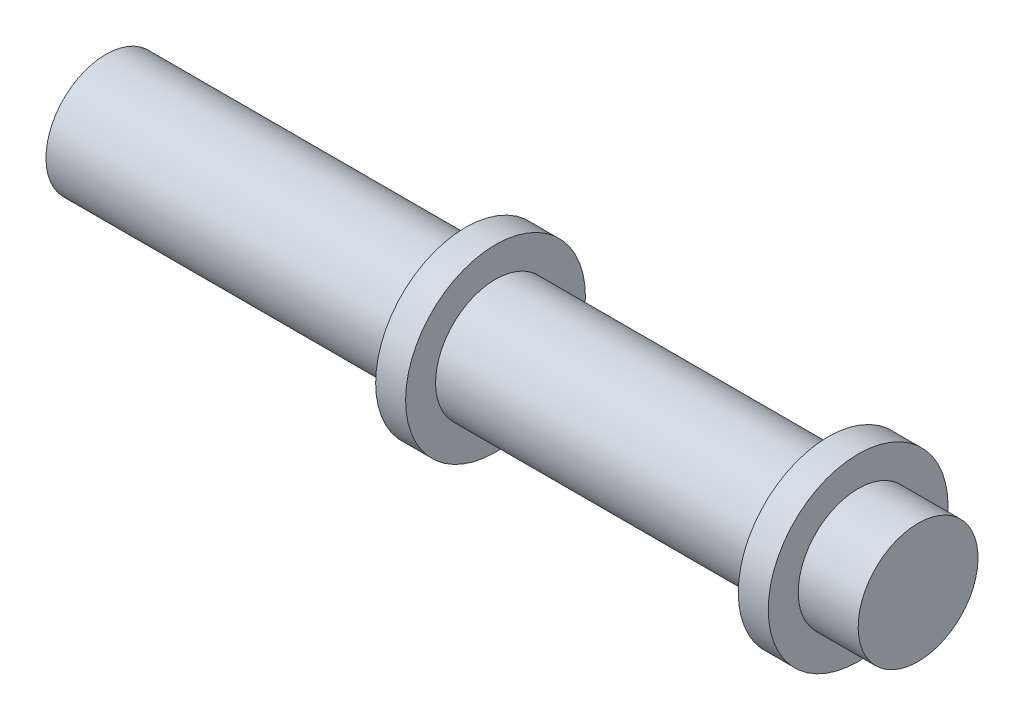
ISO-10303-21;
HEADER;
FILE_DESCRIPTION(('STEP AP214'),'2;1');
FILE_NAME('part.step','',(''),(''),'','','');
FILE_SCHEMA(('AUTOMOTIVE_DESIGN { 1 0 10303 214 1 1 1 1 }'));
ENDSEC;
DATA;
#1=APPLICATION_CONTEXT('core data for automotive mechanical design processes');
#2=APPLICATION_PROTOCOL_DEFINITION('international standard','automotive_design',2000,#1);
#3=PRODUCT_CONTEXT('',#1,'mechanical');
#4=PRODUCT('Part','Part','',(#3));
#5=PRODUCT_RELATED_PRODUCT_CATEGORY('part','',(#4));
#6=PRODUCT_DEFINITION_FORMATION('','',#4);
#7=PRODUCT_DEFINITION_CONTEXT('part definition',#1,'design');
#8=PRODUCT_DEFINITION('design','',#6,#7);
#9=PRODUCT_DEFINITION_SHAPE('','',#8);
#10=(LENGTH_UNIT() NAMED_UNIT(*) SI_UNIT(.MILLI.,.METRE.));
#11=(NAMED_UNIT(*) PLANE_ANGLE_UNIT() SI_UNIT($,.RADIAN.));
#12=(NAMED_UNIT(*) SI_UNIT($,.STERADIAN.) SOLID_ANGLE_UNIT());
#13=UNCERTAINTY_MEASURE_WITH_UNIT(LENGTH_MEASURE(1.E-05),#10,'distance_accuracy_value','');
#14=(GEOMETRIC_REPRESENTATION_CONTEXT(3) GLOBAL_UNCERTAINTY_ASSIGNED_CONTEXT((#13)) GLOBAL_UNIT_ASSIGNED_CONTEXT((#10,
#11,#12)) REPRESENTATION_CONTEXT('',''));
#15=CARTESIAN_POINT('',(0.,0.,0.));
#16=DIRECTION('',(0.,0.,1.));
#17=DIRECTION('',(1.,0.,0.));
#18=AXIS2_PLACEMENT_3D('',#15,#16,#17);
#19=CARTESIAN_POINT('',(-27.1,0.,0.));
#20=DIRECTION('',(-1.,0.,0.));
#21=DIRECTION('',(0.,-1.,0.));
#22=AXIS2_PLACEMENT_3D('',#19,#20,#21);
#23=PLANE('',#22);
#24=CARTESIAN_POINT('',(-27.1,0.,0.));
#25=DIRECTION('',(1.,0.,0.));
#26=DIRECTION('',(0.,1.,0.));
#27=AXIS2_PLACEMENT_3D('',#24,#25,#26);
#28=CIRCLE('',#27,4.00000000000002);
#29=CARTESIAN_POINT('',(-27.1,4.00000000000001,0.));
#30=VERTEX_POINT('',#29);
#31=EDGE_CURVE('E10',#30,#30,#28,.T.);
#32=ORIENTED_EDGE('',*,*,#31,.F.);
#33=EDGE_LOOP('',(#32));
#34=FACE_BOUND('',#33,.T.);
#35=ADVANCED_FACE('F41',(#34),#23,.T.);
#36=CARTESIAN_POINT('',(27.1,0.,0.));
#37=DIRECTION('',(1.,0.,0.));
#38=DIRECTION('',(0.,1.,0.));
#39=AXIS2_PLACEMENT_3D('',#36,#37,#38);
#40=CYLINDRICAL_SURFACE('',#39,4.00000000000001);
#41=ORIENTED_EDGE('',*,*,#31,.T.);
#42=EDGE_LOOP('',(#41));
#43=FACE_BOUND('',#42,.T.);
#44=CARTESIAN_POINT('',(-3.1,0.,0.));
#45=DIRECTION('',(1.,0.,0.));
#46=DIRECTION('',(0.,1.,0.));
#47=AXIS2_PLACEMENT_3D('',#44,#45,#46);
#48=CIRCLE('',#47,4.00000000000001);
#49=CARTESIAN_POINT('',(-3.1,4.,0.));
#50=VERTEX_POINT('',#49);
#51=EDGE_CURVE('E48',#50,#50,#48,.T.);
#52=ORIENTED_EDGE('',*,*,#51,.F.);
#53=EDGE_LOOP('',(#52));
#54=FACE_BOUND('',#53,.T.);
#55=ADVANCED_FACE('F105',(#43,#54),#40,.T.);
#56=CARTESIAN_POINT('',(-3.1,4.,0.));
#57=DIRECTION('',(-1.,0.,0.));
#58=DIRECTION('',(0.,-1.,0.));
#59=AXIS2_PLACEMENT_3D('',#56,#57,#58);
#60=PLANE('',#59);
#61=ORIENTED_EDGE('',*,*,#51,.T.);
#62=EDGE_LOOP('',(#61));
#63=FACE_BOUND('',#62,.T.);
#64=CARTESIAN_POINT('',(-3.1,0.,0.));
#65=DIRECTION('',(1.,0.,0.));
#66=DIRECTION('',(0.,1.,0.));
#67=AXIS2_PLACEMENT_3D('',#64,#65,#66);
#68=CIRCLE('',#67,6.00000000000001);
#69=CARTESIAN_POINT('',(-3.1,6.00000000000001,0.));
#70=VERTEX_POINT('',#69);
#71=EDGE_CURVE('E53',#70,#70,#68,.T.);
#72=ORIENTED_EDGE('',*,*,#71,.F.);
#73=EDGE_LOOP('',(#72));
#74=FACE_BOUND('',#73,.T.);
#75=ADVANCED_FACE('F110',(#63,#74),#60,.T.);
#76=CARTESIAN_POINT('',(27.1,0.,0.));
#77=DIRECTION('',(1.,0.,0.));
#78=DIRECTION('',(0.,1.,0.));
#79=AXIS2_PLACEMENT_3D('',#76,#77,#78);
#80=CYLINDRICAL_SURFACE('',#79,6.00000000000001);
#81=ORIENTED_EDGE('',*,*,#71,.T.);
#82=EDGE_LOOP('',(#81));
#83=FACE_BOUND('',#82,.T.);
#84=CARTESIAN_POINT('',(-1.1,0.,0.));
#85=DIRECTION('',(1.,0.,0.));
#86=DIRECTION('',(0.,1.,0.));
#87=AXIS2_PLACEMENT_3D('',#84,#85,#86);
#88=CIRCLE('',#87,6.00000000000001);
#89=CARTESIAN_POINT('',(-1.1,6.,0.));
#90=VERTEX_POINT('',#89);
#91=EDGE_CURVE('E58',#90,#90,#88,.T.);
#92=ORIENTED_EDGE('',*,*,#91,.F.);
#93=EDGE_LOOP('',(#92));
#94=FACE_BOUND('',#93,.T.);
#95=ADVANCED_FACE('F114',(#83,#94),#80,.T.);
#96=CARTESIAN_POINT('',(-1.1,6.,0.));
#97=DIRECTION('',(1.,0.,0.));
#98=DIRECTION('',(0.,1.,0.));
#99=AXIS2_PLACEMENT_3D('',#96,#97,#98);
#100=PLANE('',#99);
#101=ORIENTED_EDGE('',*,*,#91,.T.);
#102=EDGE_LOOP('',(#101));
#103=FACE_BOUND('',#102,.T.);
#104=CARTESIAN_POINT('',(-1.1,0.,0.));
#105=DIRECTION('',(1.,0.,0.));
#106=DIRECTION('',(0.,1.,0.));
#107=AXIS2_PLACEMENT_3D('',#104,#105,#106);
#108=CIRCLE('',#107,4.00000000000001);
#109=CARTESIAN_POINT('',(-1.1,4.,0.));
#110=VERTEX_POINT('',#109);
#111=EDGE_CURVE('E64',#110,#110,#108,.T.);
#112=ORIENTED_EDGE('',*,*,#111,.F.);
#113=EDGE_LOOP('',(#112));
#114=FACE_BOUND('',#113,.T.);
#115=ADVANCED_FACE('F120',(#103,#114),#100,.T.);
#116=CARTESIAN_POINT('',(27.1,0.,0.));
#117=DIRECTION('',(1.,0.,0.));
#118=DIRECTION('',(0.,1.,0.));
#119=AXIS2_PLACEMENT_3D('',#116,#117,#118);
#120=CYLINDRICAL_SURFACE('',#119,4.);
#121=ORIENTED_EDGE('',*,*,#111,.T.);
#122=EDGE_LOOP('',(#121));
#123=FACE_BOUND('',#122,.T.);
#124=CARTESIAN_POINT('',(21.1,0.,0.));
#125=DIRECTION('',(1.,0.,0.));
#126=DIRECTION('',(0.,1.,0.));
#127=AXIS2_PLACEMENT_3D('',#124,#125,#126);
#128=CIRCLE('',#127,4.);
#129=CARTESIAN_POINT('',(21.1,4.,0.));
#130=VERTEX_POINT('',#129);
#131=EDGE_CURVE('E68',#130,#130,#128,.T.);
#132=ORIENTED_EDGE('',*,*,#131,.F.);
#133=EDGE_LOOP('',(#132));
#134=FACE_BOUND('',#133,.T.);
#135=ADVANCED_FACE('F124',(#123,#134),#120,.T.);
#136=CARTESIAN_POINT('',(21.1,4.,0.));
#137=DIRECTION('',(-1.,0.,0.));
#138=DIRECTION('',(0.,-1.,0.));
#139=AXIS2_PLACEMENT_3D('',#136,#137,#138);
#140=PLANE('',#139);
#141=ORIENTED_EDGE('',*,*,#131,.T.);
#142=EDGE_LOOP('',(#141));
#143=FACE_BOUND('',#142,.T.);
#144=CARTESIAN_POINT('',(21.1,0.,0.));
#145=DIRECTION('',(1.,0.,0.));
#146=DIRECTION('',(0.,1.,0.));
#147=AXIS2_PLACEMENT_3D('',#144,#145,#146);
#148=CIRCLE('',#147,6.);
#149=CARTESIAN_POINT('',(21.1,6.,0.));
#150=VERTEX_POINT('',#149);
#151=EDGE_CURVE('E72',#150,#150,#148,.T.);
#152=ORIENTED_EDGE('',*,*,#151,.F.);
#153=EDGE_LOOP('',(#152));
#154=FACE_BOUND('',#153,.T.);
#155=ADVANCED_FACE('F128',(#143,#154),#140,.T.);
#156=CARTESIAN_POINT('',(27.1,0.,0.));
#157=DIRECTION('',(1.,0.,0.));
#158=DIRECTION('',(0.,1.,0.));
#159=AXIS2_PLACEMENT_3D('',#156,#157,#158);
#160=CYLINDRICAL_SURFACE('',#159,6.);
#161=ORIENTED_EDGE('',*,*,#151,.T.);
#162=EDGE_LOOP('',(#161));
#163=FACE_BOUND('',#162,.T.);
#164=CARTESIAN_POINT('',(23.1,0.,0.));
#165=DIRECTION('',(1.,0.,0.));
#166=DIRECTION('',(0.,1.,0.));
#167=AXIS2_PLACEMENT_3D('',#164,#165,#166);
#168=CIRCLE('',#167,6.);
#169=CARTESIAN_POINT('',(23.1,6.,0.));
#170=VERTEX_POINT('',#169);
#171=EDGE_CURVE('E76',#170,#170,#168,.T.);
#172=ORIENTED_EDGE('',*,*,#171,.F.);
#173=EDGE_LOOP('',(#172));
#174=FACE_BOUND('',#173,.T.);
#175=ADVANCED_FACE('F101',(#163,#174),#160,.T.);
#176=CARTESIAN_POINT('',(23.1,4.,0.));
#177=DIRECTION('',(1.,0.,0.));
#178=DIRECTION('',(0.,1.,0.));
#179=AXIS2_PLACEMENT_3D('',#176,#177,#178);
#180=PLANE('',#179);
#181=ORIENTED_EDGE('',*,*,#171,.T.);
#182=EDGE_LOOP('',(#181));
#183=FACE_BOUND('',#182,.T.);
#184=CARTESIAN_POINT('',(23.1,0.,0.));
#185=DIRECTION('',(1.,0.,0.));
#186=DIRECTION('',(0.,1.,0.));
#187=AXIS2_PLACEMENT_3D('',#184,#185,#186);
#188=CIRCLE('',#187,4.);
#189=CARTESIAN_POINT('',(23.1,4.,0.));
#190=VERTEX_POINT('',#189);
#191=EDGE_CURVE('E80',#190,#190,#188,.T.);
#192=ORIENTED_EDGE('',*,*,#191,.F.);
#193=EDGE_LOOP('',(#192));
#194=FACE_BOUND('',#193,.T.);
#195=ADVANCED_FACE('F93',(#183,#194),#180,.T.);
#196=CARTESIAN_POINT('',(27.1,0.,0.));
#197=DIRECTION('',(1.,0.,0.));
#198=DIRECTION('',(0.,1.,0.));
#199=AXIS2_PLACEMENT_3D('',#196,#197,#198);
#200=CYLINDRICAL_SURFACE('',#199,4.00000000000001);
#201=ORIENTED_EDGE('',*,*,#191,.T.);
#202=EDGE_LOOP('',(#201));
#203=FACE_BOUND('',#202,.T.);
#204=CARTESIAN_POINT('',(27.1,0.,0.));
#205=DIRECTION('',(1.,0.,0.));
#206=DIRECTION('',(0.,1.,0.));
#207=AXIS2_PLACEMENT_3D('',#204,#205,#206);
#208=CIRCLE('',#207,4.00000000000002);
#209=CARTESIAN_POINT('',(27.1,4.00000000000002,0.));
#210=VERTEX_POINT('',#209);
#211=EDGE_CURVE('E84',#210,#210,#208,.T.);
#212=ORIENTED_EDGE('',*,*,#211,.F.);
#213=EDGE_LOOP('',(#212));
#214=FACE_BOUND('',#213,.T.);
#215=ADVANCED_FACE('F91',(#203,#214),#200,.T.);
#216=CARTESIAN_POINT('',(27.1,0.,0.));
#217=DIRECTION('',(1.,0.,0.));
#218=DIRECTION('',(0.,1.,0.));
#219=AXIS2_PLACEMENT_3D('',#216,#217,#218);
#220=PLANE('',#219);
#221=ORIENTED_EDGE('',*,*,#211,.T.);
#222=EDGE_LOOP('',(#221));
#223=FACE_BOUND('',#222,.T.);
#224=ADVANCED_FACE('F89',(#223),#220,.T.);
#225=CLOSED_SHELL('',(#35,#55,#75,#95,#115,#135,#155,#175,#195,#215,#224));
#226=MANIFOLD_SOLID_BREP('B2',#225);
#227=ADVANCED_BREP_SHAPE_REPRESENTATION('',(#18,#226),#14);
#228=SHAPE_DEFINITION_REPRESENTATION(#9,#227);
ENDSEC;
END-ISO-10303-21;
